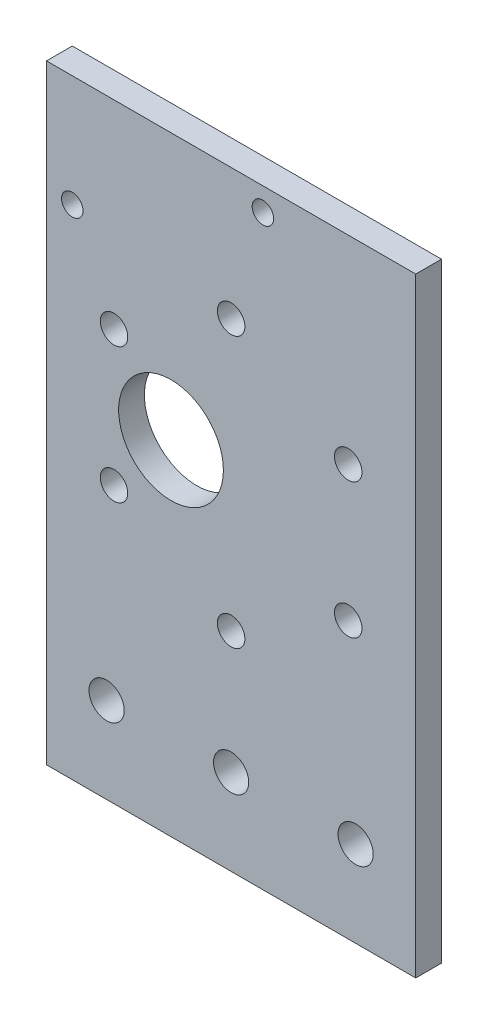
ISO-10303-21;
HEADER;
FILE_DESCRIPTION(('STEP AP214'),'2;1');
FILE_NAME('part.step','',(''),(''),'','','');
FILE_SCHEMA(('AUTOMOTIVE_DESIGN { 1 0 10303 214 1 1 1 1 }'));
ENDSEC;
DATA;
#1=APPLICATION_CONTEXT('core data for automotive mechanical design processes');
#2=APPLICATION_PROTOCOL_DEFINITION('international standard','automotive_design',2000,#1);
#3=PRODUCT_CONTEXT('',#1,'mechanical');
#4=PRODUCT('Part','Part','',(#3));
#5=PRODUCT_RELATED_PRODUCT_CATEGORY('part','',(#4));
#6=PRODUCT_DEFINITION_FORMATION('','',#4);
#7=PRODUCT_DEFINITION_CONTEXT('part definition',#1,'design');
#8=PRODUCT_DEFINITION('design','',#6,#7);
#9=PRODUCT_DEFINITION_SHAPE('','',#8);
#10=(LENGTH_UNIT() NAMED_UNIT(*) SI_UNIT(.MILLI.,.METRE.));
#11=(NAMED_UNIT(*) PLANE_ANGLE_UNIT() SI_UNIT($,.RADIAN.));
#12=(NAMED_UNIT(*) SI_UNIT($,.STERADIAN.) SOLID_ANGLE_UNIT());
#13=UNCERTAINTY_MEASURE_WITH_UNIT(LENGTH_MEASURE(1.E-05),#10,'distance_accuracy_value','');
#14=(GEOMETRIC_REPRESENTATION_CONTEXT(3) GLOBAL_UNCERTAINTY_ASSIGNED_CONTEXT((#13)) GLOBAL_UNIT_ASSIGNED_CONTEXT((#10,
#11,#12)) REPRESENTATION_CONTEXT('',''));
#15=CARTESIAN_POINT('',(0.,0.,0.));
#16=DIRECTION('',(0.,0.,1.));
#17=DIRECTION('',(1.,0.,0.));
#18=AXIS2_PLACEMENT_3D('',#15,#16,#17);
#19=CARTESIAN_POINT('',(0.,0.,3.));
#20=DIRECTION('',(0.,0.,1.));
#21=DIRECTION('',(1.,0.,0.));
#22=AXIS2_PLACEMENT_3D('',#19,#20,#21);
#23=PLANE('',#22);
#24=CARTESIAN_POINT('',(46.2,23.8,3.));
#25=DIRECTION('',(0.,0.,1.));
#26=DIRECTION('',(1.,0.,0.));
#27=AXIS2_PLACEMENT_3D('',#24,#25,#26);
#28=CIRCLE('',#27,1.24999999999999);
#29=CARTESIAN_POINT('',(47.45,23.8,3.));
#30=VERTEX_POINT('',#29);
#31=EDGE_CURVE('E178',#30,#30,#28,.T.);
#32=ORIENTED_EDGE('',*,*,#31,.F.);
#33=EDGE_LOOP('',(#32));
#34=FACE_BOUND('',#33,.T.);
#35=CARTESIAN_POINT('',(24.,13.5,3.));
#36=DIRECTION('',(0.,0.,1.));
#37=DIRECTION('',(1.,0.,0.));
#38=AXIS2_PLACEMENT_3D('',#35,#36,#37);
#39=CIRCLE('',#38,1.24999999999999);
#40=CARTESIAN_POINT('',(25.25,13.5,3.));
#41=VERTEX_POINT('',#40);
#42=EDGE_CURVE('E143',#41,#41,#39,.T.);
#43=ORIENTED_EDGE('',*,*,#42,.F.);
#44=EDGE_LOOP('',(#43));
#45=FACE_BOUND('',#44,.T.);
#46=CARTESIAN_POINT('',(42.5,-34.5,3.));
#47=DIRECTION('',(0.,0.,1.));
#48=DIRECTION('',(1.,0.,0.));
#49=AXIS2_PLACEMENT_3D('',#46,#47,#48);
#50=CIRCLE('',#49,2.05);
#51=CARTESIAN_POINT('',(44.55,-34.5,3.));
#52=VERTEX_POINT('',#51);
#53=EDGE_CURVE('E132',#52,#52,#50,.T.);
#54=ORIENTED_EDGE('',*,*,#53,.F.);
#55=EDGE_LOOP('',(#54));
#56=FACE_BOUND('',#55,.T.);
#57=CARTESIAN_POINT('',(28.8600998903951,3.37500000000006,3.));
#58=DIRECTION('',(0.,0.,1.));
#59=DIRECTION('',(1.,0.,0.));
#60=AXIS2_PLACEMENT_3D('',#57,#58,#59);
#61=CIRCLE('',#60,1.59999999999998);
#62=CARTESIAN_POINT('',(30.4600998903951,3.37500000000006,3.));
#63=VERTEX_POINT('',#62);
#64=EDGE_CURVE('E157',#63,#63,#61,.T.);
#65=ORIENTED_EDGE('',*,*,#64,.F.);
#66=EDGE_LOOP('',(#65));
#67=FACE_BOUND('',#66,.T.);
#68=CARTESIAN_POINT('',(28.8600998903951,-12.375,3.));
#69=DIRECTION('',(0.,0.,1.));
#70=DIRECTION('',(1.,0.,0.));
#71=AXIS2_PLACEMENT_3D('',#68,#69,#70);
#72=CIRCLE('',#71,1.6);
#73=CARTESIAN_POINT('',(30.4600998903951,-12.375,3.));
#74=VERTEX_POINT('',#73);
#75=EDGE_CURVE('E160',#74,#74,#72,.T.);
#76=ORIENTED_EDGE('',*,*,#75,.F.);
#77=EDGE_LOOP('',(#76));
#78=FACE_BOUND('',#77,.T.);
#79=CARTESIAN_POINT('',(42.5,-20.25,3.));
#80=DIRECTION('',(0.,0.,1.));
#81=DIRECTION('',(1.,0.,0.));
#82=AXIS2_PLACEMENT_3D('',#79,#80,#81);
#83=CIRCLE('',#82,1.6);
#84=CARTESIAN_POINT('',(44.1,-20.25,3.));
#85=VERTEX_POINT('',#84);
#86=EDGE_CURVE('E163',#85,#85,#83,.T.);
#87=ORIENTED_EDGE('',*,*,#86,.F.);
#88=EDGE_LOOP('',(#87));
#89=FACE_BOUND('',#88,.T.);
#90=CARTESIAN_POINT('',(56.139900109605,-12.375,3.));
#91=DIRECTION('',(0.,0.,1.));
#92=DIRECTION('',(1.,0.,0.));
#93=AXIS2_PLACEMENT_3D('',#90,#91,#92);
#94=CIRCLE('',#93,1.59999999999997);
#95=CARTESIAN_POINT('',(57.7399001096049,-12.375,3.));
#96=VERTEX_POINT('',#95);
#97=EDGE_CURVE('E154',#96,#96,#94,.T.);
#98=ORIENTED_EDGE('',*,*,#97,.F.);
#99=EDGE_LOOP('',(#98));
#100=FACE_BOUND('',#99,.T.);
#101=CARTESIAN_POINT('',(56.1399001096049,3.37500000000007,3.));
#102=DIRECTION('',(0.,0.,1.));
#103=DIRECTION('',(1.,0.,0.));
#104=AXIS2_PLACEMENT_3D('',#101,#102,#103);
#105=CIRCLE('',#104,1.59999999999997);
#106=CARTESIAN_POINT('',(57.7399001096049,3.37500000000007,3.));
#107=VERTEX_POINT('',#106);
#108=EDGE_CURVE('E151',#107,#107,#105,.T.);
#109=ORIENTED_EDGE('',*,*,#108,.F.);
#110=EDGE_LOOP('',(#109));
#111=FACE_BOUND('',#110,.T.);
#112=CARTESIAN_POINT('',(42.5,11.25,3.));
#113=DIRECTION('',(0.,0.,1.));
#114=DIRECTION('',(1.,0.,0.));
#115=AXIS2_PLACEMENT_3D('',#112,#113,#114);
#116=CIRCLE('',#115,1.6);
#117=CARTESIAN_POINT('',(44.1,11.25,3.));
#118=VERTEX_POINT('',#117);
#119=EDGE_CURVE('E150',#118,#118,#116,.T.);
#120=ORIENTED_EDGE('',*,*,#119,.F.);
#121=EDGE_LOOP('',(#120));
#122=FACE_BOUND('',#121,.T.);
#123=CARTESIAN_POINT('',(35.5,-4.5,3.));
#124=DIRECTION('',(0.,0.,1.));
#125=DIRECTION('',(1.,0.,0.));
#126=AXIS2_PLACEMENT_3D('',#123,#124,#125);
#127=CIRCLE('',#126,6.1);
#128=CARTESIAN_POINT('',(41.6,-4.5,3.));
#129=VERTEX_POINT('',#128);
#130=EDGE_CURVE('E111',#129,#129,#127,.T.);
#131=ORIENTED_EDGE('',*,*,#130,.F.);
#132=EDGE_LOOP('',(#131));
#133=FACE_BOUND('',#132,.T.);
#134=CARTESIAN_POINT('',(28.,-34.5,3.));
#135=DIRECTION('',(0.,0.,1.));
#136=DIRECTION('',(1.,0.,0.));
#137=AXIS2_PLACEMENT_3D('',#134,#135,#136);
#138=CIRCLE('',#137,2.05);
#139=CARTESIAN_POINT('',(30.05,-34.5,3.));
#140=VERTEX_POINT('',#139);
#141=EDGE_CURVE('E104',#140,#140,#138,.T.);
#142=ORIENTED_EDGE('',*,*,#141,.F.);
#143=EDGE_LOOP('',(#142));
#144=FACE_BOUND('',#143,.T.);
#145=CARTESIAN_POINT('',(57.,-34.5,3.));
#146=DIRECTION('',(0.,0.,1.));
#147=DIRECTION('',(1.,0.,0.));
#148=AXIS2_PLACEMENT_3D('',#145,#146,#147);
#149=CIRCLE('',#148,2.05);
#150=CARTESIAN_POINT('',(59.05,-34.5,3.));
#151=VERTEX_POINT('',#150);
#152=EDGE_CURVE('E128',#151,#151,#149,.T.);
#153=ORIENTED_EDGE('',*,*,#152,.F.);
#154=EDGE_LOOP('',(#153));
#155=FACE_BOUND('',#154,.T.);
#156=DIRECTION('',(0.,-1.,0.));
#157=VECTOR('',#156,1.);
#158=CARTESIAN_POINT('',(64.,24.5,3.));
#159=LINE('',#158,#157);
#160=CARTESIAN_POINT('',(64.,26.5,3.));
#161=VERTEX_POINT('',#160);
#162=CARTESIAN_POINT('',(64.,-44.5,3.));
#163=VERTEX_POINT('',#162);
#164=EDGE_CURVE('E11',#161,#163,#159,.T.);
#165=ORIENTED_EDGE('',*,*,#164,.F.);
#166=DIRECTION('',(1.,0.,0.));
#167=VECTOR('',#166,1.);
#168=CARTESIAN_POINT('',(64.,26.5,3.));
#169=LINE('',#168,#167);
#170=CARTESIAN_POINT('',(21.,26.5,3.));
#171=VERTEX_POINT('',#170);
#172=EDGE_CURVE('E80',#171,#161,#169,.T.);
#173=ORIENTED_EDGE('',*,*,#172,.F.);
#174=DIRECTION('',(0.,1.,0.));
#175=VECTOR('',#174,1.);
#176=CARTESIAN_POINT('',(21.,-34.5,3.));
#177=LINE('',#176,#175);
#178=CARTESIAN_POINT('',(21.,-44.5,3.));
#179=VERTEX_POINT('',#178);
#180=EDGE_CURVE('E96',#179,#171,#177,.T.);
#181=ORIENTED_EDGE('',*,*,#180,.F.);
#182=DIRECTION('',(-1.,0.,0.));
#183=VECTOR('',#182,1.);
#184=CARTESIAN_POINT('',(21.,-44.5,3.));
#185=LINE('',#184,#183);
#186=EDGE_CURVE('E60',#163,#179,#185,.T.);
#187=ORIENTED_EDGE('',*,*,#186,.F.);
#188=EDGE_LOOP('',(#165,#173,#181,#187));
#189=FACE_BOUND('',#188,.T.);
#190=ADVANCED_FACE('F35',(#34,#45,#56,#67,#78,#89,#100,#111,#122,#133,#144,#155,#189),#23,.T.);
#191=CARTESIAN_POINT('',(0.,0.,0.));
#192=DIRECTION('',(0.,0.,1.));
#193=DIRECTION('',(1.,0.,0.));
#194=AXIS2_PLACEMENT_3D('',#191,#192,#193);
#195=PLANE('',#194);
#196=CARTESIAN_POINT('',(57.,-34.5,0.));
#197=DIRECTION('',(0.,0.,1.));
#198=DIRECTION('',(1.,0.,0.));
#199=AXIS2_PLACEMENT_3D('',#196,#197,#198);
#200=CIRCLE('',#199,2.05);
#201=CARTESIAN_POINT('',(59.05,-34.5,0.));
#202=VERTEX_POINT('',#201);
#203=EDGE_CURVE('E100',#202,#202,#200,.T.);
#204=ORIENTED_EDGE('',*,*,#203,.T.);
#205=EDGE_LOOP('',(#204));
#206=FACE_BOUND('',#205,.T.);
#207=CARTESIAN_POINT('',(28.,-34.5,0.));
#208=DIRECTION('',(0.,0.,1.));
#209=DIRECTION('',(1.,0.,0.));
#210=AXIS2_PLACEMENT_3D('',#207,#208,#209);
#211=CIRCLE('',#210,2.05);
#212=CARTESIAN_POINT('',(30.05,-34.5,0.));
#213=VERTEX_POINT('',#212);
#214=EDGE_CURVE('E103',#213,#213,#211,.T.);
#215=ORIENTED_EDGE('',*,*,#214,.T.);
#216=EDGE_LOOP('',(#215));
#217=FACE_BOUND('',#216,.T.);
#218=CARTESIAN_POINT('',(35.5,-4.5,0.));
#219=DIRECTION('',(0.,0.,1.));
#220=DIRECTION('',(1.,0.,0.));
#221=AXIS2_PLACEMENT_3D('',#218,#219,#220);
#222=CIRCLE('',#221,6.1);
#223=CARTESIAN_POINT('',(41.6,-4.5,0.));
#224=VERTEX_POINT('',#223);
#225=EDGE_CURVE('E107',#224,#224,#222,.T.);
#226=ORIENTED_EDGE('',*,*,#225,.T.);
#227=EDGE_LOOP('',(#226));
#228=FACE_BOUND('',#227,.T.);
#229=CARTESIAN_POINT('',(42.5,11.25,0.));
#230=DIRECTION('',(0.,0.,1.));
#231=DIRECTION('',(1.,0.,0.));
#232=AXIS2_PLACEMENT_3D('',#229,#230,#231);
#233=CIRCLE('',#232,1.6);
#234=CARTESIAN_POINT('',(44.1,11.25,0.));
#235=VERTEX_POINT('',#234);
#236=EDGE_CURVE('E110',#235,#235,#233,.T.);
#237=ORIENTED_EDGE('',*,*,#236,.T.);
#238=EDGE_LOOP('',(#237));
#239=FACE_BOUND('',#238,.T.);
#240=CARTESIAN_POINT('',(56.1399001096049,3.37500000000007,0.));
#241=DIRECTION('',(0.,0.,1.));
#242=DIRECTION('',(1.,0.,0.));
#243=AXIS2_PLACEMENT_3D('',#240,#241,#242);
#244=CIRCLE('',#243,1.59999999999997);
#245=CARTESIAN_POINT('',(57.7399001096049,3.37500000000007,0.));
#246=VERTEX_POINT('',#245);
#247=EDGE_CURVE('E114',#246,#246,#244,.T.);
#248=ORIENTED_EDGE('',*,*,#247,.T.);
#249=EDGE_LOOP('',(#248));
#250=FACE_BOUND('',#249,.T.);
#251=CARTESIAN_POINT('',(56.139900109605,-12.375,0.));
#252=DIRECTION('',(0.,0.,1.));
#253=DIRECTION('',(1.,0.,0.));
#254=AXIS2_PLACEMENT_3D('',#251,#252,#253);
#255=CIRCLE('',#254,1.59999999999997);
#256=CARTESIAN_POINT('',(57.7399001096049,-12.375,0.));
#257=VERTEX_POINT('',#256);
#258=EDGE_CURVE('E117',#257,#257,#255,.T.);
#259=ORIENTED_EDGE('',*,*,#258,.T.);
#260=EDGE_LOOP('',(#259));
#261=FACE_BOUND('',#260,.T.);
#262=CARTESIAN_POINT('',(42.5,-20.25,0.));
#263=DIRECTION('',(0.,0.,1.));
#264=DIRECTION('',(1.,0.,0.));
#265=AXIS2_PLACEMENT_3D('',#262,#263,#264);
#266=CIRCLE('',#265,1.6);
#267=CARTESIAN_POINT('',(44.1,-20.25,0.));
#268=VERTEX_POINT('',#267);
#269=EDGE_CURVE('E120',#268,#268,#266,.T.);
#270=ORIENTED_EDGE('',*,*,#269,.T.);
#271=EDGE_LOOP('',(#270));
#272=FACE_BOUND('',#271,.T.);
#273=CARTESIAN_POINT('',(28.8600998903951,-12.375,0.));
#274=DIRECTION('',(0.,0.,1.));
#275=DIRECTION('',(1.,0.,0.));
#276=AXIS2_PLACEMENT_3D('',#273,#274,#275);
#277=CIRCLE('',#276,1.6);
#278=CARTESIAN_POINT('',(30.4600998903951,-12.375,0.));
#279=VERTEX_POINT('',#278);
#280=EDGE_CURVE('E123',#279,#279,#277,.T.);
#281=ORIENTED_EDGE('',*,*,#280,.T.);
#282=EDGE_LOOP('',(#281));
#283=FACE_BOUND('',#282,.T.);
#284=CARTESIAN_POINT('',(28.8600998903951,3.37500000000006,0.));
#285=DIRECTION('',(0.,0.,1.));
#286=DIRECTION('',(1.,0.,0.));
#287=AXIS2_PLACEMENT_3D('',#284,#285,#286);
#288=CIRCLE('',#287,1.59999999999998);
#289=CARTESIAN_POINT('',(30.4600998903951,3.37500000000006,0.));
#290=VERTEX_POINT('',#289);
#291=EDGE_CURVE('E126',#290,#290,#288,.T.);
#292=ORIENTED_EDGE('',*,*,#291,.T.);
#293=EDGE_LOOP('',(#292));
#294=FACE_BOUND('',#293,.T.);
#295=CARTESIAN_POINT('',(42.5,-34.5,0.));
#296=DIRECTION('',(0.,0.,1.));
#297=DIRECTION('',(1.,0.,0.));
#298=AXIS2_PLACEMENT_3D('',#295,#296,#297);
#299=CIRCLE('',#298,2.05);
#300=CARTESIAN_POINT('',(44.55,-34.5,0.));
#301=VERTEX_POINT('',#300);
#302=EDGE_CURVE('E129',#301,#301,#299,.T.);
#303=ORIENTED_EDGE('',*,*,#302,.T.);
#304=EDGE_LOOP('',(#303));
#305=FACE_BOUND('',#304,.T.);
#306=CARTESIAN_POINT('',(24.,13.5,0.));
#307=DIRECTION('',(0.,0.,1.));
#308=DIRECTION('',(1.,0.,0.));
#309=AXIS2_PLACEMENT_3D('',#306,#307,#308);
#310=CIRCLE('',#309,1.24999999999999);
#311=CARTESIAN_POINT('',(25.25,13.5,0.));
#312=VERTEX_POINT('',#311);
#313=EDGE_CURVE('E138',#312,#312,#310,.T.);
#314=ORIENTED_EDGE('',*,*,#313,.T.);
#315=EDGE_LOOP('',(#314));
#316=FACE_BOUND('',#315,.T.);
#317=CARTESIAN_POINT('',(46.2,23.8,0.));
#318=DIRECTION('',(0.,0.,1.));
#319=DIRECTION('',(1.,0.,0.));
#320=AXIS2_PLACEMENT_3D('',#317,#318,#319);
#321=CIRCLE('',#320,1.24999999999999);
#322=CARTESIAN_POINT('',(47.45,23.8,0.));
#323=VERTEX_POINT('',#322);
#324=EDGE_CURVE('E39',#323,#323,#321,.T.);
#325=ORIENTED_EDGE('',*,*,#324,.T.);
#326=EDGE_LOOP('',(#325));
#327=FACE_BOUND('',#326,.T.);
#328=DIRECTION('',(-1.,0.,0.));
#329=VECTOR('',#328,1.);
#330=CARTESIAN_POINT('',(64.,26.5,0.));
#331=LINE('',#330,#329);
#332=CARTESIAN_POINT('',(64.,26.5,0.));
#333=VERTEX_POINT('',#332);
#334=CARTESIAN_POINT('',(21.,26.5,0.));
#335=VERTEX_POINT('',#334);
#336=EDGE_CURVE('E52',#333,#335,#331,.T.);
#337=ORIENTED_EDGE('',*,*,#336,.F.);
#338=DIRECTION('',(0.,1.,0.));
#339=VECTOR('',#338,1.);
#340=CARTESIAN_POINT('',(64.,24.5,0.));
#341=LINE('',#340,#339);
#342=CARTESIAN_POINT('',(64.,-44.5,0.));
#343=VERTEX_POINT('',#342);
#344=EDGE_CURVE('E44',#343,#333,#341,.T.);
#345=ORIENTED_EDGE('',*,*,#344,.F.);
#346=DIRECTION('',(1.,0.,0.));
#347=VECTOR('',#346,1.);
#348=CARTESIAN_POINT('',(21.,-44.5,0.));
#349=LINE('',#348,#347);
#350=CARTESIAN_POINT('',(21.,-44.5,0.));
#351=VERTEX_POINT('',#350);
#352=EDGE_CURVE('E135',#351,#343,#349,.T.);
#353=ORIENTED_EDGE('',*,*,#352,.F.);
#354=DIRECTION('',(0.,-1.,0.));
#355=VECTOR('',#354,1.);
#356=CARTESIAN_POINT('',(21.,-34.5,0.));
#357=LINE('',#356,#355);
#358=EDGE_CURVE('E89',#335,#351,#357,.T.);
#359=ORIENTED_EDGE('',*,*,#358,.F.);
#360=EDGE_LOOP('',(#337,#345,#353,#359));
#361=FACE_BOUND('',#360,.T.);
#362=ADVANCED_FACE('F37',(#206,#217,#228,#239,#250,#261,#272,#283,#294,#305,#316,#327,#361),
#195,.F.);
#363=CARTESIAN_POINT('',(64.,0.,0.));
#364=DIRECTION('',(-1.,0.,0.));
#365=DIRECTION('',(0.,0.,1.));
#366=AXIS2_PLACEMENT_3D('',#363,#364,#365);
#367=PLANE('',#366);
#368=DIRECTION('',(0.,0.,-1.));
#369=VECTOR('',#368,1.);
#370=CARTESIAN_POINT('',(64.,26.5,3.));
#371=LINE('',#370,#369);
#372=EDGE_CURVE('E77',#161,#333,#371,.T.);
#373=ORIENTED_EDGE('',*,*,#372,.F.);
#374=ORIENTED_EDGE('',*,*,#164,.T.);
#375=DIRECTION('',(0.,0.,1.));
#376=VECTOR('',#375,1.);
#377=CARTESIAN_POINT('',(64.,-44.5,0.));
#378=LINE('',#377,#376);
#379=EDGE_CURVE('E94',#343,#163,#378,.T.);
#380=ORIENTED_EDGE('',*,*,#379,.F.);
#381=ORIENTED_EDGE('',*,*,#344,.T.);
#382=EDGE_LOOP('',(#373,#374,#380,#381));
#383=FACE_BOUND('',#382,.T.);
#384=ADVANCED_FACE('F93',(#383),#367,.F.);
#385=CARTESIAN_POINT('',(21.,0.,0.));
#386=DIRECTION('',(-1.,0.,0.));
#387=DIRECTION('',(0.,-1.,0.));
#388=AXIS2_PLACEMENT_3D('',#385,#386,#387);
#389=PLANE('',#388);
#390=ORIENTED_EDGE('',*,*,#180,.T.);
#391=DIRECTION('',(0.,0.,1.));
#392=VECTOR('',#391,1.);
#393=CARTESIAN_POINT('',(21.,26.5,3.));
#394=LINE('',#393,#392);
#395=EDGE_CURVE('E90',#335,#171,#394,.T.);
#396=ORIENTED_EDGE('',*,*,#395,.F.);
#397=ORIENTED_EDGE('',*,*,#358,.T.);
#398=DIRECTION('',(0.,0.,-1.));
#399=VECTOR('',#398,1.);
#400=CARTESIAN_POINT('',(21.,-44.5,0.));
#401=LINE('',#400,#399);
#402=EDGE_CURVE('E131',#179,#351,#401,.T.);
#403=ORIENTED_EDGE('',*,*,#402,.F.);
#404=EDGE_LOOP('',(#390,#396,#397,#403));
#405=FACE_BOUND('',#404,.T.);
#406=ADVANCED_FACE('F176',(#405),#389,.T.);
#407=CARTESIAN_POINT('',(57.,-34.5,-7.));
#408=DIRECTION('',(0.,0.,1.));
#409=DIRECTION('',(1.,0.,0.));
#410=AXIS2_PLACEMENT_3D('',#407,#408,#409);
#411=CYLINDRICAL_SURFACE('',#410,2.05);
#412=ORIENTED_EDGE('',*,*,#152,.T.);
#413=EDGE_LOOP('',(#412));
#414=FACE_BOUND('',#413,.T.);
#415=ORIENTED_EDGE('',*,*,#203,.F.);
#416=EDGE_LOOP('',(#415));
#417=FACE_BOUND('',#416,.T.);
#418=ADVANCED_FACE('F217',(#414,#417),#411,.F.);
#419=CARTESIAN_POINT('',(28.,-34.5,-7.));
#420=DIRECTION('',(0.,0.,1.));
#421=DIRECTION('',(1.,0.,0.));
#422=AXIS2_PLACEMENT_3D('',#419,#420,#421);
#423=CYLINDRICAL_SURFACE('',#422,2.05);
#424=ORIENTED_EDGE('',*,*,#141,.T.);
#425=EDGE_LOOP('',(#424));
#426=FACE_BOUND('',#425,.T.);
#427=ORIENTED_EDGE('',*,*,#214,.F.);
#428=EDGE_LOOP('',(#427));
#429=FACE_BOUND('',#428,.T.);
#430=ADVANCED_FACE('F220',(#426,#429),#423,.F.);
#431=CARTESIAN_POINT('',(35.5,-4.5,-7.));
#432=DIRECTION('',(0.,0.,1.));
#433=DIRECTION('',(1.,0.,0.));
#434=AXIS2_PLACEMENT_3D('',#431,#432,#433);
#435=CYLINDRICAL_SURFACE('',#434,6.1);
#436=ORIENTED_EDGE('',*,*,#130,.T.);
#437=EDGE_LOOP('',(#436));
#438=FACE_BOUND('',#437,.T.);
#439=ORIENTED_EDGE('',*,*,#225,.F.);
#440=EDGE_LOOP('',(#439));
#441=FACE_BOUND('',#440,.T.);
#442=ADVANCED_FACE('F224',(#438,#441),#435,.F.);
#443=CARTESIAN_POINT('',(42.5,11.25,-7.));
#444=DIRECTION('',(0.,0.,1.));
#445=DIRECTION('',(1.,0.,0.));
#446=AXIS2_PLACEMENT_3D('',#443,#444,#445);
#447=CYLINDRICAL_SURFACE('',#446,1.6);
#448=ORIENTED_EDGE('',*,*,#119,.T.);
#449=EDGE_LOOP('',(#448));
#450=FACE_BOUND('',#449,.T.);
#451=ORIENTED_EDGE('',*,*,#236,.F.);
#452=EDGE_LOOP('',(#451));
#453=FACE_BOUND('',#452,.T.);
#454=ADVANCED_FACE('F228',(#450,#453),#447,.F.);
#455=CARTESIAN_POINT('',(56.1399001096049,3.37500000000007,-7.));
#456=DIRECTION('',(0.,0.,1.));
#457=DIRECTION('',(1.,0.,0.));
#458=AXIS2_PLACEMENT_3D('',#455,#456,#457);
#459=CYLINDRICAL_SURFACE('',#458,1.59999999999997);
#460=ORIENTED_EDGE('',*,*,#108,.T.);
#461=EDGE_LOOP('',(#460));
#462=FACE_BOUND('',#461,.T.);
#463=ORIENTED_EDGE('',*,*,#247,.F.);
#464=EDGE_LOOP('',(#463));
#465=FACE_BOUND('',#464,.T.);
#466=ADVANCED_FACE('F234',(#462,#465),#459,.F.);
#467=CARTESIAN_POINT('',(56.139900109605,-12.375,-7.));
#468=DIRECTION('',(0.,0.,1.));
#469=DIRECTION('',(1.,0.,0.));
#470=AXIS2_PLACEMENT_3D('',#467,#468,#469);
#471=CYLINDRICAL_SURFACE('',#470,1.59999999999997);
#472=ORIENTED_EDGE('',*,*,#97,.T.);
#473=EDGE_LOOP('',(#472));
#474=FACE_BOUND('',#473,.T.);
#475=ORIENTED_EDGE('',*,*,#258,.F.);
#476=EDGE_LOOP('',(#475));
#477=FACE_BOUND('',#476,.T.);
#478=ADVANCED_FACE('F230',(#474,#477),#471,.F.);
#479=CARTESIAN_POINT('',(42.5,-20.25,-7.));
#480=DIRECTION('',(0.,0.,1.));
#481=DIRECTION('',(1.,0.,0.));
#482=AXIS2_PLACEMENT_3D('',#479,#480,#481);
#483=CYLINDRICAL_SURFACE('',#482,1.6);
#484=ORIENTED_EDGE('',*,*,#86,.T.);
#485=EDGE_LOOP('',(#484));
#486=FACE_BOUND('',#485,.T.);
#487=ORIENTED_EDGE('',*,*,#269,.F.);
#488=EDGE_LOOP('',(#487));
#489=FACE_BOUND('',#488,.T.);
#490=ADVANCED_FACE('F233',(#486,#489),#483,.F.);
#491=CARTESIAN_POINT('',(28.8600998903951,-12.375,-7.));
#492=DIRECTION('',(0.,0.,1.));
#493=DIRECTION('',(1.,0.,0.));
#494=AXIS2_PLACEMENT_3D('',#491,#492,#493);
#495=CYLINDRICAL_SURFACE('',#494,1.6);
#496=ORIENTED_EDGE('',*,*,#75,.T.);
#497=EDGE_LOOP('',(#496));
#498=FACE_BOUND('',#497,.T.);
#499=ORIENTED_EDGE('',*,*,#280,.F.);
#500=EDGE_LOOP('',(#499));
#501=FACE_BOUND('',#500,.T.);
#502=ADVANCED_FACE('F238',(#498,#501),#495,.F.);
#503=CARTESIAN_POINT('',(28.8600998903951,3.37500000000006,-7.));
#504=DIRECTION('',(0.,0.,1.));
#505=DIRECTION('',(1.,0.,0.));
#506=AXIS2_PLACEMENT_3D('',#503,#504,#505);
#507=CYLINDRICAL_SURFACE('',#506,1.59999999999998);
#508=ORIENTED_EDGE('',*,*,#64,.T.);
#509=EDGE_LOOP('',(#508));
#510=FACE_BOUND('',#509,.T.);
#511=ORIENTED_EDGE('',*,*,#291,.F.);
#512=EDGE_LOOP('',(#511));
#513=FACE_BOUND('',#512,.T.);
#514=ADVANCED_FACE('F242',(#510,#513),#507,.F.);
#515=CARTESIAN_POINT('',(0.,-44.5,0.));
#516=DIRECTION('',(0.,1.,0.));
#517=DIRECTION('',(0.,0.,1.));
#518=AXIS2_PLACEMENT_3D('',#515,#516,#517);
#519=PLANE('',#518);
#520=ORIENTED_EDGE('',*,*,#402,.T.);
#521=ORIENTED_EDGE('',*,*,#352,.T.);
#522=ORIENTED_EDGE('',*,*,#379,.T.);
#523=ORIENTED_EDGE('',*,*,#186,.T.);
#524=EDGE_LOOP('',(#520,#521,#522,#523));
#525=FACE_BOUND('',#524,.T.);
#526=ADVANCED_FACE('F246',(#525),#519,.F.);
#527=CARTESIAN_POINT('',(42.5,-34.5,-7.));
#528=DIRECTION('',(0.,0.,1.));
#529=DIRECTION('',(1.,0.,0.));
#530=AXIS2_PLACEMENT_3D('',#527,#528,#529);
#531=CYLINDRICAL_SURFACE('',#530,2.05);
#532=ORIENTED_EDGE('',*,*,#53,.T.);
#533=EDGE_LOOP('',(#532));
#534=FACE_BOUND('',#533,.T.);
#535=ORIENTED_EDGE('',*,*,#302,.F.);
#536=EDGE_LOOP('',(#535));
#537=FACE_BOUND('',#536,.T.);
#538=ADVANCED_FACE('F201',(#534,#537),#531,.F.);
#539=CARTESIAN_POINT('',(24.,13.5,3.));
#540=DIRECTION('',(0.,0.,1.));
#541=DIRECTION('',(1.,0.,0.));
#542=AXIS2_PLACEMENT_3D('',#539,#540,#541);
#543=CYLINDRICAL_SURFACE('',#542,1.24999999999999);
#544=ORIENTED_EDGE('',*,*,#42,.T.);
#545=EDGE_LOOP('',(#544));
#546=FACE_BOUND('',#545,.T.);
#547=ORIENTED_EDGE('',*,*,#313,.F.);
#548=EDGE_LOOP('',(#547));
#549=FACE_BOUND('',#548,.T.);
#550=ADVANCED_FACE('F192',(#546,#549),#543,.F.);
#551=CARTESIAN_POINT('',(46.2,23.8,3.));
#552=DIRECTION('',(0.,0.,1.));
#553=DIRECTION('',(1.,0.,0.));
#554=AXIS2_PLACEMENT_3D('',#551,#552,#553);
#555=CYLINDRICAL_SURFACE('',#554,1.24999999999999);
#556=ORIENTED_EDGE('',*,*,#31,.T.);
#557=EDGE_LOOP('',(#556));
#558=FACE_BOUND('',#557,.T.);
#559=ORIENTED_EDGE('',*,*,#324,.F.);
#560=EDGE_LOOP('',(#559));
#561=FACE_BOUND('',#560,.T.);
#562=ADVANCED_FACE('F190',(#558,#561),#555,.F.);
#563=CARTESIAN_POINT('',(0.,26.5,0.));
#564=DIRECTION('',(0.,1.,0.));
#565=DIRECTION('',(0.,0.,1.));
#566=AXIS2_PLACEMENT_3D('',#563,#564,#565);
#567=PLANE('',#566);
#568=ORIENTED_EDGE('',*,*,#372,.T.);
#569=ORIENTED_EDGE('',*,*,#336,.T.);
#570=ORIENTED_EDGE('',*,*,#395,.T.);
#571=ORIENTED_EDGE('',*,*,#172,.T.);
#572=EDGE_LOOP('',(#568,#569,#570,#571));
#573=FACE_BOUND('',#572,.T.);
#574=ADVANCED_FACE('F78',(#573),#567,.T.);
#575=CLOSED_SHELL('',(#190,#362,#384,#406,#418,#430,#442,#454,#466,#478,#490,#502,#514,#526,
#538,#550,#562,#574));
#576=MANIFOLD_SOLID_BREP('B2',#575);
#577=ADVANCED_BREP_SHAPE_REPRESENTATION('',(#18,#576),#14);
#578=SHAPE_DEFINITION_REPRESENTATION(#9,#577);
ENDSEC;
END-ISO-10303-21;
